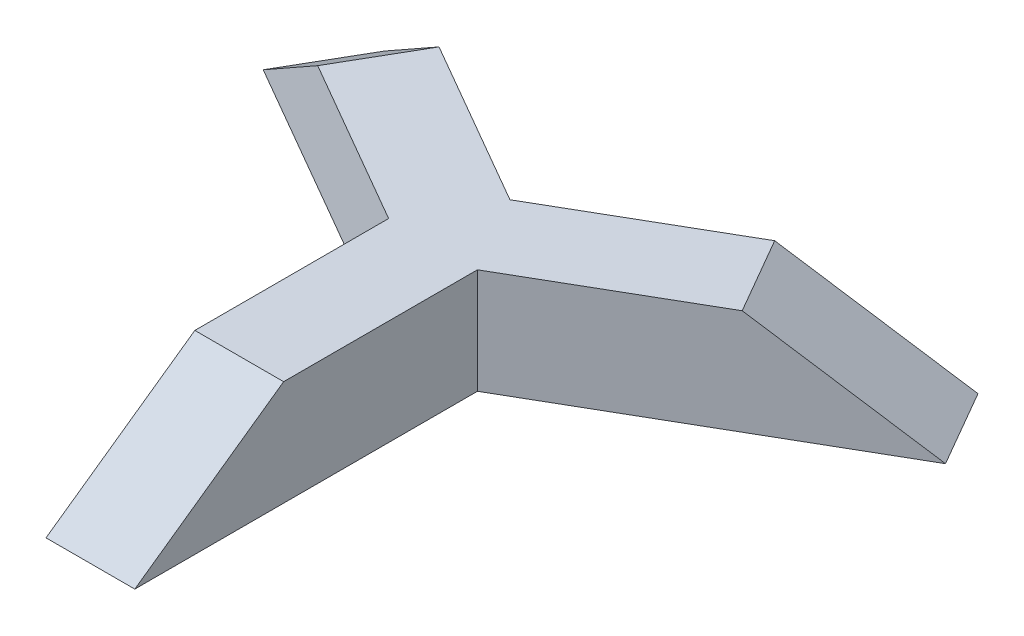
ISO-10303-21;
HEADER;
FILE_DESCRIPTION(('STEP AP214'),'2;1');
FILE_NAME('part.step','',(''),(''),'','','');
FILE_SCHEMA(('AUTOMOTIVE_DESIGN { 1 0 10303 214 1 1 1 1 }'));
ENDSEC;
DATA;
#1=APPLICATION_CONTEXT('core data for automotive mechanical design processes');
#2=APPLICATION_PROTOCOL_DEFINITION('international standard','automotive_design',2000,#1);
#3=PRODUCT_CONTEXT('',#1,'mechanical');
#4=PRODUCT('Part','Part','',(#3));
#5=PRODUCT_RELATED_PRODUCT_CATEGORY('part','',(#4));
#6=PRODUCT_DEFINITION_FORMATION('','',#4);
#7=PRODUCT_DEFINITION_CONTEXT('part definition',#1,'design');
#8=PRODUCT_DEFINITION('design','',#6,#7);
#9=PRODUCT_DEFINITION_SHAPE('','',#8);
#10=(LENGTH_UNIT() NAMED_UNIT(*) SI_UNIT(.MILLI.,.METRE.));
#11=(NAMED_UNIT(*) PLANE_ANGLE_UNIT() SI_UNIT($,.RADIAN.));
#12=(NAMED_UNIT(*) SI_UNIT($,.STERADIAN.) SOLID_ANGLE_UNIT());
#13=UNCERTAINTY_MEASURE_WITH_UNIT(LENGTH_MEASURE(1.E-05),#10,'distance_accuracy_value','');
#14=(GEOMETRIC_REPRESENTATION_CONTEXT(3) GLOBAL_UNCERTAINTY_ASSIGNED_CONTEXT((#13)) GLOBAL_UNIT_ASSIGNED_CONTEXT((#10,
#11,#12)) REPRESENTATION_CONTEXT('',''));
#15=CARTESIAN_POINT('',(0.,0.,0.));
#16=DIRECTION('',(0.,0.,1.));
#17=DIRECTION('',(1.,0.,0.));
#18=AXIS2_PLACEMENT_3D('',#15,#16,#17);
#19=CARTESIAN_POINT('',(-21.1,50.,12.1820906799011));
#20=DIRECTION('',(1.,0.,0.));
#21=DIRECTION('',(0.,0.,-1.));
#22=AXIS2_PLACEMENT_3D('',#19,#20,#21);
#23=PLANE('',#22);
#24=DIRECTION('',(0.,0.,1.));
#25=VECTOR('',#24,1.);
#26=CARTESIAN_POINT('',(-21.1,0.,12.1820906799011));
#27=LINE('',#26,#25);
#28=CARTESIAN_POINT('',(-21.1,0.,12.1820906799011));
#29=VERTEX_POINT('',#28);
#30=CARTESIAN_POINT('',(-21.1,0.,175.));
#31=VERTEX_POINT('',#30);
#32=EDGE_CURVE('E156',#29,#31,#27,.T.);
#33=ORIENTED_EDGE('',*,*,#32,.T.);
#34=DIRECTION('',(0.,-0.577287712085551,0.816540811885743));
#35=VECTOR('',#34,1.);
#36=CARTESIAN_POINT('',(-21.1,0.,175.));
#37=LINE('',#36,#35);
#38=CARTESIAN_POINT('',(-21.1,50.,104.277828473444));
#39=VERTEX_POINT('',#38);
#40=EDGE_CURVE('E76',#39,#31,#37,.T.);
#41=ORIENTED_EDGE('',*,*,#40,.F.);
#42=DIRECTION('',(0.,0.,1.));
#43=VECTOR('',#42,1.);
#44=CARTESIAN_POINT('',(-21.1,50.,12.1820906799011));
#45=LINE('',#44,#43);
#46=CARTESIAN_POINT('',(-21.1,50.,12.1820906799011));
#47=VERTEX_POINT('',#46);
#48=EDGE_CURVE('E92',#47,#39,#45,.T.);
#49=ORIENTED_EDGE('',*,*,#48,.F.);
#50=DIRECTION('',(0.,-1.,0.));
#51=VECTOR('',#50,1.);
#52=CARTESIAN_POINT('',(-21.1,50.,12.1820906799011));
#53=LINE('',#52,#51);
#54=EDGE_CURVE('E11',#47,#29,#53,.T.);
#55=ORIENTED_EDGE('',*,*,#54,.T.);
#56=EDGE_LOOP('',(#33,#41,#49,#55));
#57=FACE_BOUND('',#56,.T.);
#58=ADVANCED_FACE('F45',(#57),#23,.F.);
#59=CARTESIAN_POINT('',(21.1,50.,175.));
#60=DIRECTION('',(-1.,0.,0.));
#61=DIRECTION('',(0.,0.,1.));
#62=AXIS2_PLACEMENT_3D('',#59,#60,#61);
#63=PLANE('',#62);
#64=DIRECTION('',(0.,0.,-1.));
#65=VECTOR('',#64,1.);
#66=CARTESIAN_POINT('',(21.1,50.,175.));
#67=LINE('',#66,#65);
#68=CARTESIAN_POINT('',(21.1,50.,104.277828473444));
#69=VERTEX_POINT('',#68);
#70=CARTESIAN_POINT('',(21.1,50.,12.1820906799011));
#71=VERTEX_POINT('',#70);
#72=EDGE_CURVE('E62',#69,#71,#67,.T.);
#73=ORIENTED_EDGE('',*,*,#72,.F.);
#74=DIRECTION('',(0.,0.577287712085552,-0.816540811885744));
#75=VECTOR('',#74,1.);
#76=CARTESIAN_POINT('',(21.1,0.,175.));
#77=LINE('',#76,#75);
#78=CARTESIAN_POINT('',(21.1,0.,175.));
#79=VERTEX_POINT('',#78);
#80=EDGE_CURVE('E87',#79,#69,#77,.T.);
#81=ORIENTED_EDGE('',*,*,#80,.F.);
#82=DIRECTION('',(0.,0.,-1.));
#83=VECTOR('',#82,1.);
#84=CARTESIAN_POINT('',(21.1,0.,175.));
#85=LINE('',#84,#83);
#86=CARTESIAN_POINT('',(21.1,0.,12.1820906799011));
#87=VERTEX_POINT('',#86);
#88=EDGE_CURVE('E82',#79,#87,#85,.T.);
#89=ORIENTED_EDGE('',*,*,#88,.T.);
#90=DIRECTION('',(0.,-1.,0.));
#91=VECTOR('',#90,1.);
#92=CARTESIAN_POINT('',(21.1,50.,12.1820906799011));
#93=LINE('',#92,#91);
#94=EDGE_CURVE('E54',#71,#87,#93,.T.);
#95=ORIENTED_EDGE('',*,*,#94,.F.);
#96=EDGE_LOOP('',(#73,#81,#89,#95));
#97=FACE_BOUND('',#96,.T.);
#98=ADVANCED_FACE('F84',(#97),#63,.F.);
#99=CARTESIAN_POINT('',(0.,50.,0.));
#100=DIRECTION('',(0.,1.,0.));
#101=DIRECTION('',(0.,0.,1.));
#102=AXIS2_PLACEMENT_3D('',#99,#100,#101);
#103=PLANE('',#102);
#104=DIRECTION('',(0.500000000000004,0.,-0.866025403784436));
#105=VECTOR('',#104,1.);
#106=CARTESIAN_POINT('',(-206.611265768889,50.,149.305552780942));
#107=LINE('',#106,#105);
#108=CARTESIAN_POINT('',(-100.857248509479,50.,-33.865778216871));
#109=VERTEX_POINT('',#108);
#110=CARTESIAN_POINT('',(-79.7572485094789,50.,-70.4120502565743));
#111=VERTEX_POINT('',#110);
#112=EDGE_CURVE('E110',#109,#111,#107,.T.);
#113=ORIENTED_EDGE('',*,*,#112,.F.);
#114=DIRECTION('',(0.866025403784436,0.,0.500000000000004));
#115=VECTOR('',#114,1.);
#116=CARTESIAN_POINT('',(-162.104445662276,50.,-69.2268639801491));
#117=LINE('',#116,#115);
#118=EDGE_CURVE('E130',#109,#47,#117,.T.);
#119=ORIENTED_EDGE('',*,*,#118,.T.);
#120=ORIENTED_EDGE('',*,*,#48,.T.);
#121=DIRECTION('',(-1.,0.,0.));
#122=VECTOR('',#121,1.);
#123=CARTESIAN_POINT('',(21.101,50.,104.277828473444));
#124=LINE('',#123,#122);
#125=EDGE_CURVE('E153',#69,#39,#124,.T.);
#126=ORIENTED_EDGE('',*,*,#125,.F.);
#127=ORIENTED_EDGE('',*,*,#72,.T.);
#128=DIRECTION('',(0.866025403784443,0.,-0.499999999999992));
#129=VECTOR('',#128,1.);
#130=CARTESIAN_POINT('',(21.0999999999999,50.,12.1820906799013));
#131=LINE('',#130,#129);
#132=CARTESIAN_POINT('',(100.857248509479,50.,-33.8657782168696));
#133=VERTEX_POINT('',#132);
#134=EDGE_CURVE('E102',#71,#133,#131,.T.);
#135=ORIENTED_EDGE('',*,*,#134,.T.);
#136=DIRECTION('',(0.499999999999992,0.,0.866025403784443));
#137=VECTOR('',#136,1.);
#138=CARTESIAN_POINT('',(3.97934266564089,50.,-201.663233269275));
#139=LINE('',#138,#137);
#140=CARTESIAN_POINT('',(79.7572485094798,50.,-70.4120502565731));
#141=VERTEX_POINT('',#140);
#142=EDGE_CURVE('E185',#141,#133,#139,.T.);
#143=ORIENTED_EDGE('',*,*,#142,.F.);
#144=DIRECTION('',(-0.866025403784443,0.,0.499999999999992));
#145=VECTOR('',#144,1.);
#146=CARTESIAN_POINT('',(141.004445662278,50.,-105.77313601985));
#147=LINE('',#146,#145);
#148=CARTESIAN_POINT('',(1.14491749414469E-13,50.,-24.3641813598022));
#149=VERTEX_POINT('',#148);
#150=EDGE_CURVE('E120',#141,#149,#147,.T.);
#151=ORIENTED_EDGE('',*,*,#150,.T.);
#152=DIRECTION('',(-0.866025403784437,0.,-0.500000000000004));
#153=VECTOR('',#152,1.);
#154=CARTESIAN_POINT('',(1.14491749414469E-13,50.,-24.3641813598022));
#155=LINE('',#154,#153);
#156=EDGE_CURVE('E126',#149,#111,#155,.T.);
#157=ORIENTED_EDGE('',*,*,#156,.T.);
#158=EDGE_LOOP('',(#113,#119,#120,#126,#127,#135,#143,#151,#157));
#159=FACE_BOUND('',#158,.T.);
#160=ADVANCED_FACE('F208',(#159),#103,.T.);
#161=CARTESIAN_POINT('',(0.,0.,0.));
#162=DIRECTION('',(0.,1.,0.));
#163=DIRECTION('',(0.,0.,1.));
#164=AXIS2_PLACEMENT_3D('',#161,#162,#163);
#165=PLANE('',#164);
#166=ORIENTED_EDGE('',*,*,#32,.F.);
#167=DIRECTION('',(0.866025403784436,0.,0.500000000000004));
#168=VECTOR('',#167,1.);
#169=CARTESIAN_POINT('',(-162.104445662276,0.,-69.2268639801491));
#170=LINE('',#169,#168);
#171=CARTESIAN_POINT('',(-162.104445662276,0.,-69.2268639801491));
#172=VERTEX_POINT('',#171);
#173=EDGE_CURVE('E131',#172,#29,#170,.T.);
#174=ORIENTED_EDGE('',*,*,#173,.F.);
#175=DIRECTION('',(-0.500000000000004,0.,0.866025403784436));
#176=VECTOR('',#175,1.);
#177=CARTESIAN_POINT('',(-141.004445662276,0.,-105.773136019852));
#178=LINE('',#177,#176);
#179=CARTESIAN_POINT('',(-141.004445662276,0.,-105.773136019852));
#180=VERTEX_POINT('',#179);
#181=EDGE_CURVE('E139',#180,#172,#178,.T.);
#182=ORIENTED_EDGE('',*,*,#181,.F.);
#183=DIRECTION('',(-0.866025403784437,0.,-0.500000000000004));
#184=VECTOR('',#183,1.);
#185=CARTESIAN_POINT('',(1.14491749414469E-13,0.,-24.3641813598022));
#186=LINE('',#185,#184);
#187=CARTESIAN_POINT('',(1.14491749414469E-13,0.,-24.3641813598022));
#188=VERTEX_POINT('',#187);
#189=EDGE_CURVE('E135',#188,#180,#186,.T.);
#190=ORIENTED_EDGE('',*,*,#189,.F.);
#191=DIRECTION('',(-0.866025403784443,0.,0.499999999999992));
#192=VECTOR('',#191,1.);
#193=CARTESIAN_POINT('',(141.004445662278,0.,-105.77313601985));
#194=LINE('',#193,#192);
#195=CARTESIAN_POINT('',(141.004445662278,0.,-105.77313601985));
#196=VERTEX_POINT('',#195);
#197=EDGE_CURVE('E114',#196,#188,#194,.T.);
#198=ORIENTED_EDGE('',*,*,#197,.F.);
#199=DIRECTION('',(-0.499999999999992,0.,-0.866025403784443));
#200=VECTOR('',#199,1.);
#201=CARTESIAN_POINT('',(162.104445662277,0.,-69.2268639801468));
#202=LINE('',#201,#200);
#203=CARTESIAN_POINT('',(162.104445662277,0.,-69.2268639801468));
#204=VERTEX_POINT('',#203);
#205=EDGE_CURVE('E108',#204,#196,#202,.T.);
#206=ORIENTED_EDGE('',*,*,#205,.F.);
#207=DIRECTION('',(0.866025403784443,0.,-0.499999999999992));
#208=VECTOR('',#207,1.);
#209=CARTESIAN_POINT('',(21.0999999999999,0.,12.1820906799013));
#210=LINE('',#209,#208);
#211=EDGE_CURVE('E100',#87,#204,#210,.T.);
#212=ORIENTED_EDGE('',*,*,#211,.F.);
#213=ORIENTED_EDGE('',*,*,#88,.F.);
#214=DIRECTION('',(1.,0.,0.));
#215=VECTOR('',#214,1.);
#216=CARTESIAN_POINT('',(-21.1,0.,175.));
#217=LINE('',#216,#215);
#218=EDGE_CURVE('E93',#31,#79,#217,.T.);
#219=ORIENTED_EDGE('',*,*,#218,.F.);
#220=EDGE_LOOP('',(#166,#174,#182,#190,#198,#206,#212,#213,#219));
#221=FACE_BOUND('',#220,.T.);
#222=ADVANCED_FACE('F105',(#221),#165,.F.);
#223=CARTESIAN_POINT('',(21.101,0.,175.));
#224=DIRECTION('',(0.,-0.816540811885744,-0.577287712085552));
#225=DIRECTION('',(0.,0.577287712085552,-0.816540811885744));
#226=AXIS2_PLACEMENT_3D('',#223,#224,#225);
#227=PLANE('',#226);
#228=ORIENTED_EDGE('',*,*,#80,.T.);
#229=ORIENTED_EDGE('',*,*,#125,.T.);
#230=ORIENTED_EDGE('',*,*,#40,.T.);
#231=ORIENTED_EDGE('',*,*,#218,.T.);
#232=EDGE_LOOP('',(#228,#229,#230,#231));
#233=FACE_BOUND('',#232,.T.);
#234=ADVANCED_FACE('F165',(#233),#227,.F.);
#235=CARTESIAN_POINT('',(1.14491749414469E-13,50.,-24.3641813598022));
#236=DIRECTION('',(-0.500000000000004,0.,0.866025403784436));
#237=DIRECTION('',(0.866025403784436,0.,0.500000000000004));
#238=AXIS2_PLACEMENT_3D('',#235,#236,#237);
#239=PLANE('',#238);
#240=ORIENTED_EDGE('',*,*,#189,.T.);
#241=DIRECTION('',(-0.707145086319823,-0.577287712085551,-0.408270405942875));
#242=VECTOR('',#241,1.);
#243=CARTESIAN_POINT('',(-141.004445662276,0.,-105.773136019852));
#244=LINE('',#243,#242);
#245=EDGE_CURVE('E117',#111,#180,#244,.T.);
#246=ORIENTED_EDGE('',*,*,#245,.F.);
#247=ORIENTED_EDGE('',*,*,#156,.F.);
#248=DIRECTION('',(0.,-1.,0.));
#249=VECTOR('',#248,1.);
#250=CARTESIAN_POINT('',(1.14491749414469E-13,50.,-24.3641813598022));
#251=LINE('',#250,#249);
#252=EDGE_CURVE('E134',#149,#188,#251,.T.);
#253=ORIENTED_EDGE('',*,*,#252,.T.);
#254=EDGE_LOOP('',(#240,#246,#247,#253));
#255=FACE_BOUND('',#254,.T.);
#256=ADVANCED_FACE('F218',(#255),#239,.F.);
#257=CARTESIAN_POINT('',(-162.104445662276,50.,-69.2268639801491));
#258=DIRECTION('',(0.500000000000004,0.,-0.866025403784436));
#259=DIRECTION('',(-0.866025403784436,0.,-0.500000000000004));
#260=AXIS2_PLACEMENT_3D('',#257,#258,#259);
#261=PLANE('',#260);
#262=ORIENTED_EDGE('',*,*,#118,.F.);
#263=DIRECTION('',(0.707145086319823,0.577287712085552,0.408270405942875));
#264=VECTOR('',#263,1.);
#265=CARTESIAN_POINT('',(-162.104445662276,0.,-69.2268639801491));
#266=LINE('',#265,#264);
#267=EDGE_CURVE('E177',#172,#109,#266,.T.);
#268=ORIENTED_EDGE('',*,*,#267,.F.);
#269=ORIENTED_EDGE('',*,*,#173,.T.);
#270=ORIENTED_EDGE('',*,*,#54,.F.);
#271=EDGE_LOOP('',(#262,#268,#269,#270));
#272=FACE_BOUND('',#271,.T.);
#273=ADVANCED_FACE('F175',(#272),#261,.F.);
#274=CARTESIAN_POINT('',(21.0999999999999,50.,12.1820906799013));
#275=DIRECTION('',(-0.499999999999992,0.,-0.866025403784443));
#276=DIRECTION('',(-0.866025403784443,0.,0.499999999999992));
#277=AXIS2_PLACEMENT_3D('',#274,#275,#276);
#278=PLANE('',#277);
#279=ORIENTED_EDGE('',*,*,#211,.T.);
#280=DIRECTION('',(0.707145086319828,-0.577287712085551,-0.408270405942865));
#281=VECTOR('',#280,1.);
#282=CARTESIAN_POINT('',(162.104445662277,0.,-69.2268639801468));
#283=LINE('',#282,#281);
#284=EDGE_CURVE('E192',#133,#204,#283,.T.);
#285=ORIENTED_EDGE('',*,*,#284,.F.);
#286=ORIENTED_EDGE('',*,*,#134,.F.);
#287=ORIENTED_EDGE('',*,*,#94,.T.);
#288=EDGE_LOOP('',(#279,#285,#286,#287));
#289=FACE_BOUND('',#288,.T.);
#290=ADVANCED_FACE('F97',(#289),#278,.F.);
#291=CARTESIAN_POINT('',(141.004445662278,50.,-105.77313601985));
#292=DIRECTION('',(0.499999999999992,0.,0.866025403784443));
#293=DIRECTION('',(0.866025403784443,0.,-0.499999999999992));
#294=AXIS2_PLACEMENT_3D('',#291,#292,#293);
#295=PLANE('',#294);
#296=ORIENTED_EDGE('',*,*,#150,.F.);
#297=DIRECTION('',(-0.707145086319828,0.577287712085552,0.408270405942865));
#298=VECTOR('',#297,1.);
#299=CARTESIAN_POINT('',(141.004445662278,0.,-105.77313601985));
#300=LINE('',#299,#298);
#301=EDGE_CURVE('E195',#196,#141,#300,.T.);
#302=ORIENTED_EDGE('',*,*,#301,.F.);
#303=ORIENTED_EDGE('',*,*,#197,.T.);
#304=ORIENTED_EDGE('',*,*,#252,.F.);
#305=EDGE_LOOP('',(#296,#302,#303,#304));
#306=FACE_BOUND('',#305,.T.);
#307=ADVANCED_FACE('F220',(#306),#295,.F.);
#308=CARTESIAN_POINT('',(65.2265398184388,0.,-237.024319032553));
#309=DIRECTION('',(-0.499945823958687,-0.816540811885744,0.288643856042771));
#310=DIRECTION('',(0.852840663005878,-0.522171239655818,0.));
#311=AXIS2_PLACEMENT_3D('',#308,#309,#310);
#312=PLANE('',#311);
#313=ORIENTED_EDGE('',*,*,#301,.T.);
#314=ORIENTED_EDGE('',*,*,#142,.T.);
#315=ORIENTED_EDGE('',*,*,#284,.T.);
#316=ORIENTED_EDGE('',*,*,#205,.T.);
#317=EDGE_LOOP('',(#313,#314,#315,#316));
#318=FACE_BOUND('',#317,.T.);
#319=ADVANCED_FACE('F236',(#318),#312,.F.);
#320=CARTESIAN_POINT('',(-267.858462921687,0.,113.944467017664));
#321=DIRECTION('',(0.499945823958683,-0.816540811885744,0.288643856042778));
#322=DIRECTION('',(0.85284066300588,0.522171239655815,0.));
#323=AXIS2_PLACEMENT_3D('',#320,#321,#322);
#324=PLANE('',#323);
#325=ORIENTED_EDGE('',*,*,#267,.T.);
#326=ORIENTED_EDGE('',*,*,#112,.T.);
#327=ORIENTED_EDGE('',*,*,#245,.T.);
#328=ORIENTED_EDGE('',*,*,#181,.T.);
#329=EDGE_LOOP('',(#325,#326,#327,#328));
#330=FACE_BOUND('',#329,.T.);
#331=ADVANCED_FACE('F232',(#330),#324,.F.);
#332=CLOSED_SHELL('',(#58,#98,#160,#222,#234,#256,#273,#290,#307,#319,#331));
#333=MANIFOLD_SOLID_BREP('B2',#332);
#334=ADVANCED_BREP_SHAPE_REPRESENTATION('',(#18,#333),#14);
#335=SHAPE_DEFINITION_REPRESENTATION(#9,#334);
ENDSEC;
END-ISO-10303-21;
